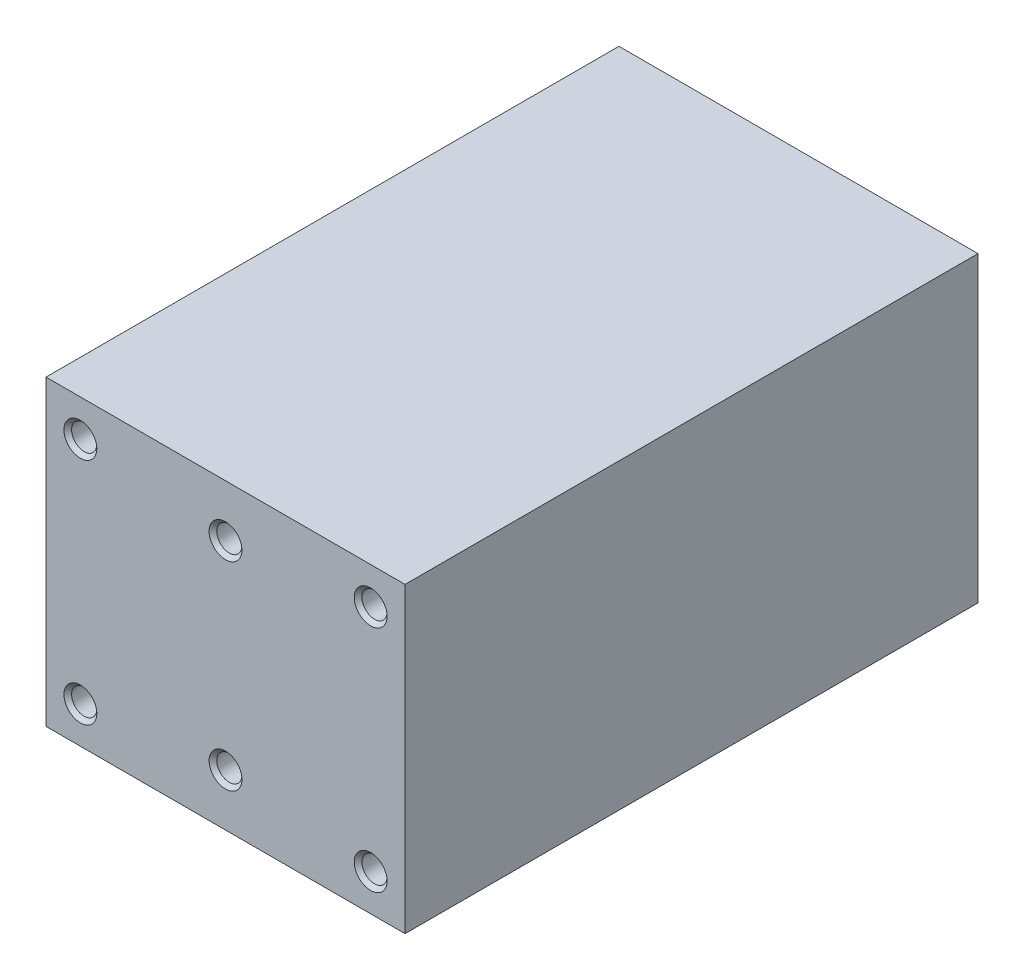
ISO-10303-21;
HEADER;
FILE_DESCRIPTION(('STEP AP214'),'2;1');
FILE_NAME('part.step','',(''),(''),'','','');
FILE_SCHEMA(('AUTOMOTIVE_DESIGN { 1 0 10303 214 1 1 1 1 }'));
ENDSEC;
DATA;
#1=APPLICATION_CONTEXT('core data for automotive mechanical design processes');
#2=APPLICATION_PROTOCOL_DEFINITION('international standard','automotive_design',2000,#1);
#3=PRODUCT_CONTEXT('',#1,'mechanical');
#4=PRODUCT('Part','Part','',(#3));
#5=PRODUCT_RELATED_PRODUCT_CATEGORY('part','',(#4));
#6=PRODUCT_DEFINITION_FORMATION('','',#4);
#7=PRODUCT_DEFINITION_CONTEXT('part definition',#1,'design');
#8=PRODUCT_DEFINITION('design','',#6,#7);
#9=PRODUCT_DEFINITION_SHAPE('','',#8);
#10=(LENGTH_UNIT() NAMED_UNIT(*) SI_UNIT(.MILLI.,.METRE.));
#11=(NAMED_UNIT(*) PLANE_ANGLE_UNIT() SI_UNIT($,.RADIAN.));
#12=(NAMED_UNIT(*) SI_UNIT($,.STERADIAN.) SOLID_ANGLE_UNIT());
#13=UNCERTAINTY_MEASURE_WITH_UNIT(LENGTH_MEASURE(1.E-05),#10,'distance_accuracy_value','');
#14=(GEOMETRIC_REPRESENTATION_CONTEXT(3) GLOBAL_UNCERTAINTY_ASSIGNED_CONTEXT((#13)) GLOBAL_UNIT_ASSIGNED_CONTEXT((#10,
#11,#12)) REPRESENTATION_CONTEXT('',''));
#15=CARTESIAN_POINT('',(0.,0.,0.));
#16=DIRECTION('',(0.,0.,1.));
#17=DIRECTION('',(1.,0.,0.));
#18=AXIS2_PLACEMENT_3D('',#15,#16,#17);
#19=CARTESIAN_POINT('',(0.,0.,75.));
#20=DIRECTION('',(1.,0.,0.));
#21=DIRECTION('',(0.,0.,-1.));
#22=AXIS2_PLACEMENT_3D('',#19,#20,#21);
#23=PLANE('',#22);
#24=DIRECTION('',(0.,-1.,0.));
#25=VECTOR('',#24,1.);
#26=CARTESIAN_POINT('',(0.,0.,0.));
#27=LINE('',#26,#25);
#28=CARTESIAN_POINT('',(0.,39.6,0.));
#29=VERTEX_POINT('',#28);
#30=CARTESIAN_POINT('',(0.,0.,0.));
#31=VERTEX_POINT('',#30);
#32=EDGE_CURVE('E150',#29,#31,#27,.T.);
#33=ORIENTED_EDGE('',*,*,#32,.T.);
#34=DIRECTION('',(0.,0.,-1.));
#35=VECTOR('',#34,1.);
#36=CARTESIAN_POINT('',(0.,0.,75.));
#37=LINE('',#36,#35);
#38=CARTESIAN_POINT('',(0.,0.,75.));
#39=VERTEX_POINT('',#38);
#40=EDGE_CURVE('E180',#39,#31,#37,.T.);
#41=ORIENTED_EDGE('',*,*,#40,.F.);
#42=DIRECTION('',(0.,-1.,0.));
#43=VECTOR('',#42,1.);
#44=CARTESIAN_POINT('',(0.,0.,75.));
#45=LINE('',#44,#43);
#46=CARTESIAN_POINT('',(0.,39.6,75.));
#47=VERTEX_POINT('',#46);
#48=EDGE_CURVE('E151',#47,#39,#45,.T.);
#49=ORIENTED_EDGE('',*,*,#48,.F.);
#50=DIRECTION('',(0.,0.,-1.));
#51=VECTOR('',#50,1.);
#52=CARTESIAN_POINT('',(0.,39.6,75.));
#53=LINE('',#52,#51);
#54=EDGE_CURVE('E161',#47,#29,#53,.T.);
#55=ORIENTED_EDGE('',*,*,#54,.T.);
#56=EDGE_LOOP('',(#33,#41,#49,#55));
#57=FACE_BOUND('',#56,.T.);
#58=ADVANCED_FACE('F47',(#57),#23,.F.);
#59=CARTESIAN_POINT('',(0.,0.,75.));
#60=DIRECTION('',(0.,1.,0.));
#61=DIRECTION('',(0.,0.,1.));
#62=AXIS2_PLACEMENT_3D('',#59,#60,#61);
#63=PLANE('',#62);
#64=DIRECTION('',(1.,0.,0.));
#65=VECTOR('',#64,1.);
#66=CARTESIAN_POINT('',(0.,0.,0.));
#67=LINE('',#66,#65);
#68=CARTESIAN_POINT('',(47.,0.,0.));
#69=VERTEX_POINT('',#68);
#70=EDGE_CURVE('E165',#31,#69,#67,.T.);
#71=ORIENTED_EDGE('',*,*,#70,.T.);
#72=DIRECTION('',(0.,0.,-1.));
#73=VECTOR('',#72,1.);
#74=CARTESIAN_POINT('',(47.,0.,75.));
#75=LINE('',#74,#73);
#76=CARTESIAN_POINT('',(47.,0.,75.));
#77=VERTEX_POINT('',#76);
#78=EDGE_CURVE('E177',#77,#69,#75,.T.);
#79=ORIENTED_EDGE('',*,*,#78,.F.);
#80=DIRECTION('',(1.,0.,0.));
#81=VECTOR('',#80,1.);
#82=CARTESIAN_POINT('',(0.,0.,75.));
#83=LINE('',#82,#81);
#84=EDGE_CURVE('E98',#39,#77,#83,.T.);
#85=ORIENTED_EDGE('',*,*,#84,.F.);
#86=ORIENTED_EDGE('',*,*,#40,.T.);
#87=EDGE_LOOP('',(#71,#79,#85,#86));
#88=FACE_BOUND('',#87,.T.);
#89=ADVANCED_FACE('F243',(#88),#63,.F.);
#90=CARTESIAN_POINT('',(47.,0.,75.));
#91=DIRECTION('',(-1.,0.,0.));
#92=DIRECTION('',(0.,0.,1.));
#93=AXIS2_PLACEMENT_3D('',#90,#91,#92);
#94=PLANE('',#93);
#95=DIRECTION('',(0.,1.,0.));
#96=VECTOR('',#95,1.);
#97=CARTESIAN_POINT('',(47.,0.,0.));
#98=LINE('',#97,#96);
#99=CARTESIAN_POINT('',(47.,39.6,0.));
#100=VERTEX_POINT('',#99);
#101=EDGE_CURVE('E84',#69,#100,#98,.T.);
#102=ORIENTED_EDGE('',*,*,#101,.T.);
#103=DIRECTION('',(0.,0.,-1.));
#104=VECTOR('',#103,1.);
#105=CARTESIAN_POINT('',(47.,39.6,75.));
#106=LINE('',#105,#104);
#107=CARTESIAN_POINT('',(47.,39.6,75.));
#108=VERTEX_POINT('',#107);
#109=EDGE_CURVE('E174',#108,#100,#106,.T.);
#110=ORIENTED_EDGE('',*,*,#109,.F.);
#111=DIRECTION('',(0.,1.,0.));
#112=VECTOR('',#111,1.);
#113=CARTESIAN_POINT('',(47.,0.,75.));
#114=LINE('',#113,#112);
#115=EDGE_CURVE('E156',#77,#108,#114,.T.);
#116=ORIENTED_EDGE('',*,*,#115,.F.);
#117=ORIENTED_EDGE('',*,*,#78,.T.);
#118=EDGE_LOOP('',(#102,#110,#116,#117));
#119=FACE_BOUND('',#118,.T.);
#120=ADVANCED_FACE('F249',(#119),#94,.F.);
#121=CARTESIAN_POINT('',(0.,39.6,75.));
#122=DIRECTION('',(0.,-1.,0.));
#123=DIRECTION('',(0.,0.,-1.));
#124=AXIS2_PLACEMENT_3D('',#121,#122,#123);
#125=PLANE('',#124);
#126=DIRECTION('',(-1.,0.,0.));
#127=VECTOR('',#126,1.);
#128=CARTESIAN_POINT('',(0.,39.6,0.));
#129=LINE('',#128,#127);
#130=EDGE_CURVE('E90',#100,#29,#129,.T.);
#131=ORIENTED_EDGE('',*,*,#130,.T.);
#132=ORIENTED_EDGE('',*,*,#54,.F.);
#133=DIRECTION('',(-1.,0.,0.));
#134=VECTOR('',#133,1.);
#135=CARTESIAN_POINT('',(0.,39.6,75.));
#136=LINE('',#135,#134);
#137=EDGE_CURVE('E66',#108,#47,#136,.T.);
#138=ORIENTED_EDGE('',*,*,#137,.F.);
#139=ORIENTED_EDGE('',*,*,#109,.T.);
#140=EDGE_LOOP('',(#131,#132,#138,#139));
#141=FACE_BOUND('',#140,.T.);
#142=ADVANCED_FACE('F320',(#141),#125,.F.);
#143=CARTESIAN_POINT('',(0.,0.,75.));
#144=DIRECTION('',(0.,0.,-1.));
#145=DIRECTION('',(-1.,0.,0.));
#146=AXIS2_PLACEMENT_3D('',#143,#144,#145);
#147=PLANE('',#146);
#148=CARTESIAN_POINT('',(4.50000000000001,4.8,75.));
#149=DIRECTION('',(0.,0.,-1.));
#150=DIRECTION('',(-1.,0.,0.));
#151=AXIS2_PLACEMENT_3D('',#148,#149,#150);
#152=CIRCLE('',#151,2.15);
#153=CARTESIAN_POINT('',(2.35000000000001,4.8,75.));
#154=VERTEX_POINT('',#153);
#155=EDGE_CURVE('E207',#154,#154,#152,.T.);
#156=ORIENTED_EDGE('',*,*,#155,.T.);
#157=EDGE_LOOP('',(#156));
#158=FACE_BOUND('',#157,.T.);
#159=CARTESIAN_POINT('',(23.5,6.8,75.));
#160=DIRECTION('',(0.,0.,-1.));
#161=DIRECTION('',(-1.,0.,0.));
#162=AXIS2_PLACEMENT_3D('',#159,#160,#161);
#163=CIRCLE('',#162,2.14999999999999);
#164=CARTESIAN_POINT('',(21.35,6.8,75.));
#165=VERTEX_POINT('',#164);
#166=EDGE_CURVE('E203',#165,#165,#163,.T.);
#167=ORIENTED_EDGE('',*,*,#166,.T.);
#168=EDGE_LOOP('',(#167));
#169=FACE_BOUND('',#168,.T.);
#170=CARTESIAN_POINT('',(42.5,4.8,75.));
#171=DIRECTION('',(0.,0.,-1.));
#172=DIRECTION('',(-1.,0.,0.));
#173=AXIS2_PLACEMENT_3D('',#170,#171,#172);
#174=CIRCLE('',#173,2.14999999999999);
#175=CARTESIAN_POINT('',(40.35,4.8,75.));
#176=VERTEX_POINT('',#175);
#177=EDGE_CURVE('E199',#176,#176,#174,.T.);
#178=ORIENTED_EDGE('',*,*,#177,.T.);
#179=EDGE_LOOP('',(#178));
#180=FACE_BOUND('',#179,.T.);
#181=CARTESIAN_POINT('',(42.5,34.8,75.));
#182=DIRECTION('',(0.,0.,-1.));
#183=DIRECTION('',(-1.,0.,0.));
#184=AXIS2_PLACEMENT_3D('',#181,#182,#183);
#185=CIRCLE('',#184,2.14999999999999);
#186=CARTESIAN_POINT('',(40.35,34.8,75.));
#187=VERTEX_POINT('',#186);
#188=EDGE_CURVE('E195',#187,#187,#185,.T.);
#189=ORIENTED_EDGE('',*,*,#188,.T.);
#190=EDGE_LOOP('',(#189));
#191=FACE_BOUND('',#190,.T.);
#192=CARTESIAN_POINT('',(23.5,32.8,75.));
#193=DIRECTION('',(0.,0.,-1.));
#194=DIRECTION('',(-1.,0.,0.));
#195=AXIS2_PLACEMENT_3D('',#192,#193,#194);
#196=CIRCLE('',#195,2.15);
#197=CARTESIAN_POINT('',(21.35,32.8,75.));
#198=VERTEX_POINT('',#197);
#199=EDGE_CURVE('E191',#198,#198,#196,.T.);
#200=ORIENTED_EDGE('',*,*,#199,.T.);
#201=EDGE_LOOP('',(#200));
#202=FACE_BOUND('',#201,.T.);
#203=CARTESIAN_POINT('',(4.5,34.8,75.));
#204=DIRECTION('',(0.,0.,-1.));
#205=DIRECTION('',(-1.,0.,0.));
#206=AXIS2_PLACEMENT_3D('',#203,#204,#205);
#207=CIRCLE('',#206,2.15);
#208=CARTESIAN_POINT('',(2.35,34.8,75.));
#209=VERTEX_POINT('',#208);
#210=EDGE_CURVE('E187',#209,#209,#207,.T.);
#211=ORIENTED_EDGE('',*,*,#210,.T.);
#212=EDGE_LOOP('',(#211));
#213=FACE_BOUND('',#212,.T.);
#214=ORIENTED_EDGE('',*,*,#48,.T.);
#215=ORIENTED_EDGE('',*,*,#84,.T.);
#216=ORIENTED_EDGE('',*,*,#115,.T.);
#217=ORIENTED_EDGE('',*,*,#137,.T.);
#218=EDGE_LOOP('',(#214,#215,#216,#217));
#219=FACE_BOUND('',#218,.T.);
#220=ADVANCED_FACE('F317',(#158,#169,#180,#191,#202,#213,#219),#147,.F.);
#221=CARTESIAN_POINT('',(0.,0.,0.));
#222=DIRECTION('',(0.,0.,-1.));
#223=DIRECTION('',(-1.,0.,0.));
#224=AXIS2_PLACEMENT_3D('',#221,#222,#223);
#225=PLANE('',#224);
#226=ORIENTED_EDGE('',*,*,#32,.F.);
#227=ORIENTED_EDGE('',*,*,#130,.F.);
#228=ORIENTED_EDGE('',*,*,#101,.F.);
#229=ORIENTED_EDGE('',*,*,#70,.F.);
#230=EDGE_LOOP('',(#226,#227,#228,#229));
#231=FACE_BOUND('',#230,.T.);
#232=ADVANCED_FACE('F315',(#231),#225,.T.);
#233=CARTESIAN_POINT('',(4.50000000000001,4.8,60.));
#234=DIRECTION('',(0.,0.,1.));
#235=DIRECTION('',(1.,0.,0.));
#236=AXIS2_PLACEMENT_3D('',#233,#234,#235);
#237=CONICAL_SURFACE('',#236,1.65,1.02974425867665);
#238=CARTESIAN_POINT('',(4.5,4.8,59.0085799786045));
#239=VERTEX_POINT('',#238);
#240=VERTEX_LOOP('',#239);
#241=FACE_BOUND('',#240,.T.);
#242=CARTESIAN_POINT('',(4.50000000000001,4.8,60.));
#243=DIRECTION('',(0.,0.,1.));
#244=DIRECTION('',(1.,0.,0.));
#245=AXIS2_PLACEMENT_3D('',#242,#243,#244);
#246=CIRCLE('',#245,1.65);
#247=CARTESIAN_POINT('',(6.15,4.8,60.));
#248=VERTEX_POINT('',#247);
#249=EDGE_CURVE('E146',#248,#248,#246,.T.);
#250=ORIENTED_EDGE('',*,*,#249,.T.);
#251=EDGE_LOOP('',(#250));
#252=FACE_BOUND('',#251,.T.);
#253=ADVANCED_FACE('F311',(#241,#252),#237,.F.);
#254=CARTESIAN_POINT('',(4.50000000000001,4.8,75.));
#255=DIRECTION('',(0.,0.,1.));
#256=DIRECTION('',(1.,0.,0.));
#257=AXIS2_PLACEMENT_3D('',#254,#255,#256);
#258=CYLINDRICAL_SURFACE('',#257,1.64999999999999);
#259=CARTESIAN_POINT('',(4.50000000000001,4.8,74.5));
#260=DIRECTION('',(0.,0.,-1.));
#261=DIRECTION('',(-1.,0.,0.));
#262=AXIS2_PLACEMENT_3D('',#259,#260,#261);
#263=CIRCLE('',#262,1.64999999999999);
#264=CARTESIAN_POINT('',(2.85000000000001,4.8,74.5));
#265=VERTEX_POINT('',#264);
#266=EDGE_CURVE('E183',#265,#265,#263,.F.);
#267=ORIENTED_EDGE('',*,*,#266,.T.);
#268=EDGE_LOOP('',(#267));
#269=FACE_BOUND('',#268,.T.);
#270=ORIENTED_EDGE('',*,*,#249,.F.);
#271=EDGE_LOOP('',(#270));
#272=FACE_BOUND('',#271,.T.);
#273=ADVANCED_FACE('F307',(#269,#272),#258,.F.);
#274=CARTESIAN_POINT('',(23.5,6.8,60.));
#275=DIRECTION('',(0.,0.,1.));
#276=DIRECTION('',(1.,0.,0.));
#277=AXIS2_PLACEMENT_3D('',#274,#275,#276);
#278=CONICAL_SURFACE('',#277,1.65,1.02974425867665);
#279=CARTESIAN_POINT('',(23.5,6.8,59.0085799786045));
#280=VERTEX_POINT('',#279);
#281=VERTEX_LOOP('',#280);
#282=FACE_BOUND('',#281,.T.);
#283=CARTESIAN_POINT('',(23.5,6.8,60.));
#284=DIRECTION('',(0.,0.,1.));
#285=DIRECTION('',(1.,0.,0.));
#286=AXIS2_PLACEMENT_3D('',#283,#284,#285);
#287=CIRCLE('',#286,1.65);
#288=CARTESIAN_POINT('',(25.15,6.8,60.));
#289=VERTEX_POINT('',#288);
#290=EDGE_CURVE('E142',#289,#289,#287,.T.);
#291=ORIENTED_EDGE('',*,*,#290,.T.);
#292=EDGE_LOOP('',(#291));
#293=FACE_BOUND('',#292,.T.);
#294=ADVANCED_FACE('F300',(#282,#293),#278,.F.);
#295=CARTESIAN_POINT('',(23.5,6.8,75.));
#296=DIRECTION('',(0.,0.,1.));
#297=DIRECTION('',(1.,0.,0.));
#298=AXIS2_PLACEMENT_3D('',#295,#296,#297);
#299=CYLINDRICAL_SURFACE('',#298,1.64999999999999);
#300=CARTESIAN_POINT('',(23.5,6.8,74.5));
#301=DIRECTION('',(0.,0.,-1.));
#302=DIRECTION('',(-1.,0.,0.));
#303=AXIS2_PLACEMENT_3D('',#300,#301,#302);
#304=CIRCLE('',#303,1.64999999999999);
#305=CARTESIAN_POINT('',(21.85,6.8,74.5));
#306=VERTEX_POINT('',#305);
#307=EDGE_CURVE('E211',#306,#306,#304,.F.);
#308=ORIENTED_EDGE('',*,*,#307,.T.);
#309=EDGE_LOOP('',(#308));
#310=FACE_BOUND('',#309,.T.);
#311=ORIENTED_EDGE('',*,*,#290,.F.);
#312=EDGE_LOOP('',(#311));
#313=FACE_BOUND('',#312,.T.);
#314=ADVANCED_FACE('F294',(#310,#313),#299,.F.);
#315=CARTESIAN_POINT('',(42.5,4.8,60.));
#316=DIRECTION('',(0.,0.,1.));
#317=DIRECTION('',(1.,0.,0.));
#318=AXIS2_PLACEMENT_3D('',#315,#316,#317);
#319=CONICAL_SURFACE('',#318,1.65,1.02974425867665);
#320=CARTESIAN_POINT('',(42.5,4.8,59.0085799786045));
#321=VERTEX_POINT('',#320);
#322=VERTEX_LOOP('',#321);
#323=FACE_BOUND('',#322,.T.);
#324=CARTESIAN_POINT('',(42.5,4.8,60.));
#325=DIRECTION('',(0.,0.,1.));
#326=DIRECTION('',(1.,0.,0.));
#327=AXIS2_PLACEMENT_3D('',#324,#325,#326);
#328=CIRCLE('',#327,1.65);
#329=CARTESIAN_POINT('',(44.15,4.8,60.));
#330=VERTEX_POINT('',#329);
#331=EDGE_CURVE('E138',#330,#330,#328,.T.);
#332=ORIENTED_EDGE('',*,*,#331,.T.);
#333=EDGE_LOOP('',(#332));
#334=FACE_BOUND('',#333,.T.);
#335=ADVANCED_FACE('F289',(#323,#334),#319,.F.);
#336=CARTESIAN_POINT('',(42.5,4.8,75.));
#337=DIRECTION('',(0.,0.,1.));
#338=DIRECTION('',(1.,0.,0.));
#339=AXIS2_PLACEMENT_3D('',#336,#337,#338);
#340=CYLINDRICAL_SURFACE('',#339,1.65);
#341=CARTESIAN_POINT('',(42.5,4.8,74.5));
#342=DIRECTION('',(0.,0.,-1.));
#343=DIRECTION('',(-1.,0.,0.));
#344=AXIS2_PLACEMENT_3D('',#341,#342,#343);
#345=CIRCLE('',#344,1.65);
#346=CARTESIAN_POINT('',(40.85,4.8,74.5));
#347=VERTEX_POINT('',#346);
#348=EDGE_CURVE('E215',#347,#347,#345,.F.);
#349=ORIENTED_EDGE('',*,*,#348,.T.);
#350=EDGE_LOOP('',(#349));
#351=FACE_BOUND('',#350,.T.);
#352=ORIENTED_EDGE('',*,*,#331,.F.);
#353=EDGE_LOOP('',(#352));
#354=FACE_BOUND('',#353,.T.);
#355=ADVANCED_FACE('F285',(#351,#354),#340,.F.);
#356=CARTESIAN_POINT('',(42.5,34.8,60.));
#357=DIRECTION('',(0.,0.,1.));
#358=DIRECTION('',(1.,0.,0.));
#359=AXIS2_PLACEMENT_3D('',#356,#357,#358);
#360=CONICAL_SURFACE('',#359,1.65,1.02974425867665);
#361=CARTESIAN_POINT('',(42.5,34.8,59.0085799786045));
#362=VERTEX_POINT('',#361);
#363=VERTEX_LOOP('',#362);
#364=FACE_BOUND('',#363,.T.);
#365=CARTESIAN_POINT('',(42.5,34.8,60.));
#366=DIRECTION('',(0.,0.,1.));
#367=DIRECTION('',(1.,0.,0.));
#368=AXIS2_PLACEMENT_3D('',#365,#366,#367);
#369=CIRCLE('',#368,1.65);
#370=CARTESIAN_POINT('',(44.15,34.8,60.));
#371=VERTEX_POINT('',#370);
#372=EDGE_CURVE('E132',#371,#371,#369,.T.);
#373=ORIENTED_EDGE('',*,*,#372,.T.);
#374=EDGE_LOOP('',(#373));
#375=FACE_BOUND('',#374,.T.);
#376=ADVANCED_FACE('F288',(#364,#375),#360,.F.);
#377=CARTESIAN_POINT('',(42.5,34.8,75.));
#378=DIRECTION('',(0.,0.,1.));
#379=DIRECTION('',(1.,0.,0.));
#380=AXIS2_PLACEMENT_3D('',#377,#378,#379);
#381=CYLINDRICAL_SURFACE('',#380,1.65);
#382=CARTESIAN_POINT('',(42.5,34.8,74.5));
#383=DIRECTION('',(0.,0.,-1.));
#384=DIRECTION('',(-1.,0.,0.));
#385=AXIS2_PLACEMENT_3D('',#382,#383,#384);
#386=CIRCLE('',#385,1.65);
#387=CARTESIAN_POINT('',(40.85,34.8,74.5));
#388=VERTEX_POINT('',#387);
#389=EDGE_CURVE('E219',#388,#388,#386,.F.);
#390=ORIENTED_EDGE('',*,*,#389,.T.);
#391=EDGE_LOOP('',(#390));
#392=FACE_BOUND('',#391,.T.);
#393=ORIENTED_EDGE('',*,*,#372,.F.);
#394=EDGE_LOOP('',(#393));
#395=FACE_BOUND('',#394,.T.);
#396=ADVANCED_FACE('F373',(#392,#395),#381,.F.);
#397=CARTESIAN_POINT('',(23.5,32.8,60.));
#398=DIRECTION('',(0.,0.,1.));
#399=DIRECTION('',(1.,0.,0.));
#400=AXIS2_PLACEMENT_3D('',#397,#398,#399);
#401=CONICAL_SURFACE('',#400,1.65,1.02974425867665);
#402=CARTESIAN_POINT('',(23.5,32.8,59.0085799786045));
#403=VERTEX_POINT('',#402);
#404=VERTEX_LOOP('',#403);
#405=FACE_BOUND('',#404,.T.);
#406=CARTESIAN_POINT('',(23.5,32.8,60.));
#407=DIRECTION('',(0.,0.,1.));
#408=DIRECTION('',(1.,0.,0.));
#409=AXIS2_PLACEMENT_3D('',#406,#407,#408);
#410=CIRCLE('',#409,1.65);
#411=CARTESIAN_POINT('',(25.15,32.8,60.));
#412=VERTEX_POINT('',#411);
#413=EDGE_CURVE('E128',#412,#412,#410,.T.);
#414=ORIENTED_EDGE('',*,*,#413,.T.);
#415=EDGE_LOOP('',(#414));
#416=FACE_BOUND('',#415,.T.);
#417=ADVANCED_FACE('F377',(#405,#416),#401,.F.);
#418=CARTESIAN_POINT('',(23.5,32.8,75.));
#419=DIRECTION('',(0.,0.,1.));
#420=DIRECTION('',(1.,0.,0.));
#421=AXIS2_PLACEMENT_3D('',#418,#419,#420);
#422=CYLINDRICAL_SURFACE('',#421,1.64999999999999);
#423=CARTESIAN_POINT('',(23.5,32.8,74.5));
#424=DIRECTION('',(0.,0.,-1.));
#425=DIRECTION('',(-1.,0.,0.));
#426=AXIS2_PLACEMENT_3D('',#423,#424,#425);
#427=CIRCLE('',#426,1.64999999999999);
#428=CARTESIAN_POINT('',(21.85,32.8,74.5));
#429=VERTEX_POINT('',#428);
#430=EDGE_CURVE('E58',#429,#429,#427,.F.);
#431=ORIENTED_EDGE('',*,*,#430,.T.);
#432=EDGE_LOOP('',(#431));
#433=FACE_BOUND('',#432,.T.);
#434=ORIENTED_EDGE('',*,*,#413,.F.);
#435=EDGE_LOOP('',(#434));
#436=FACE_BOUND('',#435,.T.);
#437=ADVANCED_FACE('F121',(#433,#436),#422,.F.);
#438=CARTESIAN_POINT('',(4.5,34.8,60.));
#439=DIRECTION('',(0.,0.,1.));
#440=DIRECTION('',(1.,0.,0.));
#441=AXIS2_PLACEMENT_3D('',#438,#439,#440);
#442=CONICAL_SURFACE('',#441,1.65,1.02974425867665);
#443=CARTESIAN_POINT('',(4.5,34.8,59.0085799786045));
#444=VERTEX_POINT('',#443);
#445=VERTEX_LOOP('',#444);
#446=FACE_BOUND('',#445,.T.);
#447=CARTESIAN_POINT('',(4.5,34.8,60.));
#448=DIRECTION('',(0.,0.,1.));
#449=DIRECTION('',(1.,0.,0.));
#450=AXIS2_PLACEMENT_3D('',#447,#448,#449);
#451=CIRCLE('',#450,1.65);
#452=CARTESIAN_POINT('',(6.15,34.8,60.));
#453=VERTEX_POINT('',#452);
#454=EDGE_CURVE('E125',#453,#453,#451,.T.);
#455=ORIENTED_EDGE('',*,*,#454,.T.);
#456=EDGE_LOOP('',(#455));
#457=FACE_BOUND('',#456,.T.);
#458=ADVANCED_FACE('F117',(#446,#457),#442,.F.);
#459=CARTESIAN_POINT('',(4.5,34.8,75.));
#460=DIRECTION('',(0.,0.,1.));
#461=DIRECTION('',(1.,0.,0.));
#462=AXIS2_PLACEMENT_3D('',#459,#460,#461);
#463=CYLINDRICAL_SURFACE('',#462,1.64999999999999);
#464=CARTESIAN_POINT('',(4.5,34.8,74.5));
#465=DIRECTION('',(0.,0.,-1.));
#466=DIRECTION('',(-1.,0.,0.));
#467=AXIS2_PLACEMENT_3D('',#464,#465,#466);
#468=CIRCLE('',#467,1.64999999999999);
#469=CARTESIAN_POINT('',(2.85000000000001,34.8,74.5));
#470=VERTEX_POINT('',#469);
#471=EDGE_CURVE('E11',#470,#470,#468,.F.);
#472=ORIENTED_EDGE('',*,*,#471,.T.);
#473=EDGE_LOOP('',(#472));
#474=FACE_BOUND('',#473,.T.);
#475=ORIENTED_EDGE('',*,*,#454,.F.);
#476=EDGE_LOOP('',(#475));
#477=FACE_BOUND('',#476,.T.);
#478=ADVANCED_FACE('F120',(#474,#477),#463,.F.);
#479=CARTESIAN_POINT('',(4.50000000000001,4.8,74.5));
#480=DIRECTION('',(0.,0.,1.));
#481=DIRECTION('',(1.,0.,0.));
#482=AXIS2_PLACEMENT_3D('',#479,#480,#481);
#483=CONICAL_SURFACE('',#482,1.64999999999999,0.785398163397454);
#484=ORIENTED_EDGE('',*,*,#155,.F.);
#485=EDGE_LOOP('',(#484));
#486=FACE_BOUND('',#485,.T.);
#487=ORIENTED_EDGE('',*,*,#266,.F.);
#488=EDGE_LOOP('',(#487));
#489=FACE_BOUND('',#488,.T.);
#490=ADVANCED_FACE('F254',(#486,#489),#483,.F.);
#491=CARTESIAN_POINT('',(23.5,6.8,74.5));
#492=DIRECTION('',(0.,0.,1.));
#493=DIRECTION('',(1.,0.,0.));
#494=AXIS2_PLACEMENT_3D('',#491,#492,#493);
#495=CONICAL_SURFACE('',#494,1.64999999999999,0.785398163397455);
#496=ORIENTED_EDGE('',*,*,#166,.F.);
#497=EDGE_LOOP('',(#496));
#498=FACE_BOUND('',#497,.T.);
#499=ORIENTED_EDGE('',*,*,#307,.F.);
#500=EDGE_LOOP('',(#499));
#501=FACE_BOUND('',#500,.T.);
#502=ADVANCED_FACE('F260',(#498,#501),#495,.F.);
#503=CARTESIAN_POINT('',(42.5,4.8,74.5));
#504=DIRECTION('',(0.,0.,1.));
#505=DIRECTION('',(1.,0.,0.));
#506=AXIS2_PLACEMENT_3D('',#503,#504,#505);
#507=CONICAL_SURFACE('',#506,1.65,0.785398163397445);
#508=ORIENTED_EDGE('',*,*,#177,.F.);
#509=EDGE_LOOP('',(#508));
#510=FACE_BOUND('',#509,.T.);
#511=ORIENTED_EDGE('',*,*,#348,.F.);
#512=EDGE_LOOP('',(#511));
#513=FACE_BOUND('',#512,.T.);
#514=ADVANCED_FACE('F237',(#510,#513),#507,.F.);
#515=CARTESIAN_POINT('',(42.5,34.8,74.5));
#516=DIRECTION('',(0.,0.,1.));
#517=DIRECTION('',(1.,0.,0.));
#518=AXIS2_PLACEMENT_3D('',#515,#516,#517);
#519=CONICAL_SURFACE('',#518,1.65,0.785398163397445);
#520=ORIENTED_EDGE('',*,*,#188,.F.);
#521=EDGE_LOOP('',(#520));
#522=FACE_BOUND('',#521,.T.);
#523=ORIENTED_EDGE('',*,*,#389,.F.);
#524=EDGE_LOOP('',(#523));
#525=FACE_BOUND('',#524,.T.);
#526=ADVANCED_FACE('F230',(#522,#525),#519,.F.);
#527=CARTESIAN_POINT('',(23.5,32.8,74.5));
#528=DIRECTION('',(0.,0.,1.));
#529=DIRECTION('',(1.,0.,0.));
#530=AXIS2_PLACEMENT_3D('',#527,#528,#529);
#531=CONICAL_SURFACE('',#530,1.64999999999999,0.785398163397454);
#532=ORIENTED_EDGE('',*,*,#199,.F.);
#533=EDGE_LOOP('',(#532));
#534=FACE_BOUND('',#533,.T.);
#535=ORIENTED_EDGE('',*,*,#430,.F.);
#536=EDGE_LOOP('',(#535));
#537=FACE_BOUND('',#536,.T.);
#538=ADVANCED_FACE('F228',(#534,#537),#531,.F.);
#539=CARTESIAN_POINT('',(4.5,34.8,74.5));
#540=DIRECTION('',(0.,0.,1.));
#541=DIRECTION('',(1.,0.,0.));
#542=AXIS2_PLACEMENT_3D('',#539,#540,#541);
#543=CONICAL_SURFACE('',#542,1.64999999999999,0.785398163397454);
#544=ORIENTED_EDGE('',*,*,#210,.F.);
#545=EDGE_LOOP('',(#544));
#546=FACE_BOUND('',#545,.T.);
#547=ORIENTED_EDGE('',*,*,#471,.F.);
#548=EDGE_LOOP('',(#547));
#549=FACE_BOUND('',#548,.T.);
#550=ADVANCED_FACE('F50',(#546,#549),#543,.F.);
#551=CLOSED_SHELL('',(#58,#89,#120,#142,#220,#232,#253,#273,#294,#314,#335,#355,#376,#396,#417,
#437,#458,#478,#490,#502,#514,#526,#538,#550));
#552=MANIFOLD_SOLID_BREP('B2',#551);
#553=ADVANCED_BREP_SHAPE_REPRESENTATION('',(#18,#552),#14);
#554=SHAPE_DEFINITION_REPRESENTATION(#9,#553);
ENDSEC;
END-ISO-10303-21;
